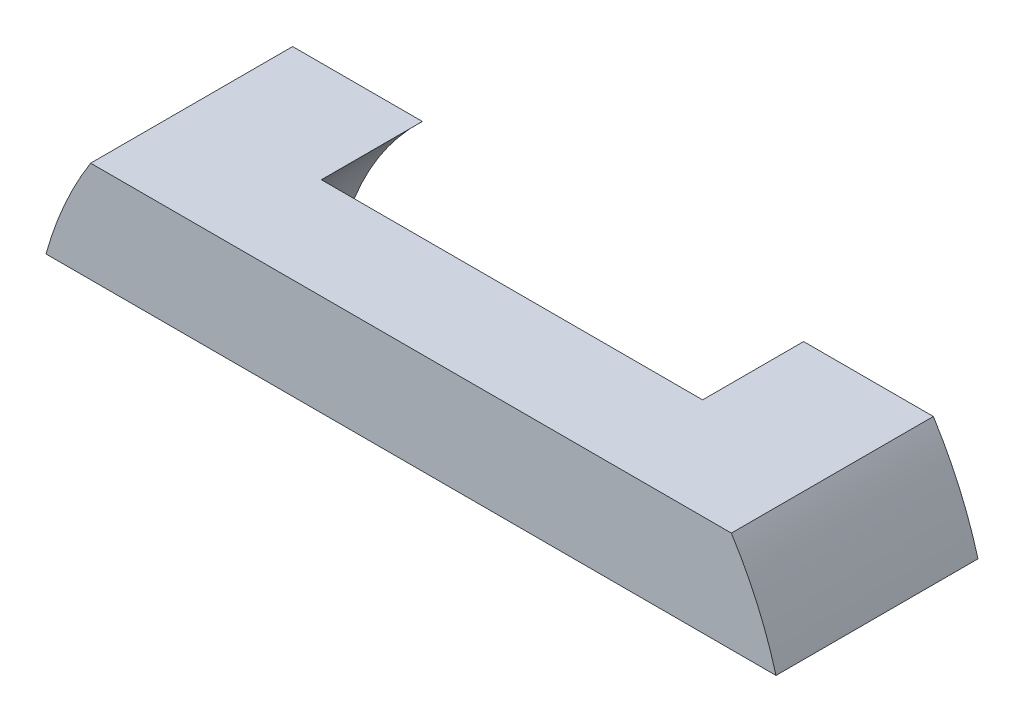
ISO-10303-21;
HEADER;
FILE_DESCRIPTION(('STEP AP214'),'2;1');
FILE_NAME('part.step','',(''),(''),'','','');
FILE_SCHEMA(('AUTOMOTIVE_DESIGN { 1 0 10303 214 1 1 1 1 }'));
ENDSEC;
DATA;
#1=APPLICATION_CONTEXT('core data for automotive mechanical design processes');
#2=APPLICATION_PROTOCOL_DEFINITION('international standard','automotive_design',2000,#1);
#3=PRODUCT_CONTEXT('',#1,'mechanical');
#4=PRODUCT('Part','Part','',(#3));
#5=PRODUCT_RELATED_PRODUCT_CATEGORY('part','',(#4));
#6=PRODUCT_DEFINITION_FORMATION('','',#4);
#7=PRODUCT_DEFINITION_CONTEXT('part definition',#1,'design');
#8=PRODUCT_DEFINITION('design','',#6,#7);
#9=PRODUCT_DEFINITION_SHAPE('','',#8);
#10=(LENGTH_UNIT() NAMED_UNIT(*) SI_UNIT(.MILLI.,.METRE.));
#11=(NAMED_UNIT(*) PLANE_ANGLE_UNIT() SI_UNIT($,.RADIAN.));
#12=(NAMED_UNIT(*) SI_UNIT($,.STERADIAN.) SOLID_ANGLE_UNIT());
#13=UNCERTAINTY_MEASURE_WITH_UNIT(LENGTH_MEASURE(1.E-05),#10,'distance_accuracy_value','');
#14=(GEOMETRIC_REPRESENTATION_CONTEXT(3) GLOBAL_UNCERTAINTY_ASSIGNED_CONTEXT((#13)) GLOBAL_UNIT_ASSIGNED_CONTEXT((#10,
#11,#12)) REPRESENTATION_CONTEXT('',''));
#15=CARTESIAN_POINT('',(0.,0.,0.));
#16=DIRECTION('',(0.,0.,1.));
#17=DIRECTION('',(1.,0.,0.));
#18=AXIS2_PLACEMENT_3D('',#15,#16,#17);
#19=CARTESIAN_POINT('',(0.,0.,0.));
#20=DIRECTION('',(0.,0.,-1.));
#21=DIRECTION('',(-1.,0.,0.));
#22=AXIS2_PLACEMENT_3D('',#19,#20,#21);
#23=PLANE('',#22);
#24=CARTESIAN_POINT('',(0.,0.,0.));
#25=DIRECTION('',(0.,0.,-1.));
#26=DIRECTION('',(-1.,0.,0.));
#27=AXIS2_PLACEMENT_3D('',#24,#25,#26);
#28=CIRCLE('',#27,8.73125);
#29=CARTESIAN_POINT('',(-8.13351717048043,3.175,0.));
#30=VERTEX_POINT('',#29);
#31=CARTESIAN_POINT('',(-5.99268108299616,6.35,0.));
#32=VERTEX_POINT('',#31);
#33=EDGE_CURVE('E302',#30,#32,#28,.T.);
#34=ORIENTED_EDGE('',*,*,#33,.F.);
#35=DIRECTION('',(1.,0.,0.));
#36=VECTOR('',#35,1.);
#37=CARTESIAN_POINT('',(-11.4751106339983,3.175,0.));
#38=LINE('',#37,#36);
#39=CARTESIAN_POINT('',(-11.4751106339983,3.175,0.));
#40=VERTEX_POINT('',#39);
#41=EDGE_CURVE('E141',#40,#30,#38,.T.);
#42=ORIENTED_EDGE('',*,*,#41,.F.);
#43=CARTESIAN_POINT('',(0.,0.,0.));
#44=DIRECTION('',(0.,0.,1.));
#45=DIRECTION('',(-1.,0.,0.));
#46=AXIS2_PLACEMENT_3D('',#43,#44,#45);
#47=CIRCLE('',#46,11.90625);
#48=CARTESIAN_POINT('',(-10.0715584227318,6.35,0.));
#49=VERTEX_POINT('',#48);
#50=EDGE_CURVE('E129',#49,#40,#47,.T.);
#51=ORIENTED_EDGE('',*,*,#50,.F.);
#52=DIRECTION('',(-1.,0.,0.));
#53=VECTOR('',#52,1.);
#54=CARTESIAN_POINT('',(-10.0715584227318,6.35,0.));
#55=LINE('',#54,#53);
#56=EDGE_CURVE('E89',#32,#49,#55,.T.);
#57=ORIENTED_EDGE('',*,*,#56,.F.);
#58=EDGE_LOOP('',(#34,#42,#51,#57));
#59=FACE_BOUND('',#58,.T.);
#60=ADVANCED_FACE('F43',(#59),#23,.T.);
#61=CARTESIAN_POINT('',(0.,0.,6.35));
#62=DIRECTION('',(0.,0.,-1.));
#63=DIRECTION('',(-1.,0.,0.));
#64=AXIS2_PLACEMENT_3D('',#61,#62,#63);
#65=CYLINDRICAL_SURFACE('',#64,11.90625);
#66=ORIENTED_EDGE('',*,*,#50,.T.);
#67=DIRECTION('',(0.,0.,-1.));
#68=VECTOR('',#67,1.);
#69=CARTESIAN_POINT('',(-11.4751106339983,3.175,6.35));
#70=LINE('',#69,#68);
#71=CARTESIAN_POINT('',(-11.4751106339983,3.175,6.35));
#72=VERTEX_POINT('',#71);
#73=EDGE_CURVE('E184',#72,#40,#70,.T.);
#74=ORIENTED_EDGE('',*,*,#73,.F.);
#75=CARTESIAN_POINT('',(0.,0.,6.35));
#76=DIRECTION('',(0.,0.,1.));
#77=DIRECTION('',(-1.,0.,0.));
#78=AXIS2_PLACEMENT_3D('',#75,#76,#77);
#79=CIRCLE('',#78,11.90625);
#80=CARTESIAN_POINT('',(-10.0715584227318,6.35,6.35));
#81=VERTEX_POINT('',#80);
#82=EDGE_CURVE('E150',#81,#72,#79,.T.);
#83=ORIENTED_EDGE('',*,*,#82,.F.);
#84=DIRECTION('',(0.,0.,-1.));
#85=VECTOR('',#84,1.);
#86=CARTESIAN_POINT('',(-10.0715584227318,6.35,6.35));
#87=LINE('',#86,#85);
#88=EDGE_CURVE('E161',#81,#49,#87,.T.);
#89=ORIENTED_EDGE('',*,*,#88,.T.);
#90=EDGE_LOOP('',(#66,#74,#83,#89));
#91=FACE_BOUND('',#90,.T.);
#92=ADVANCED_FACE('F45',(#91),#65,.T.);
#93=CARTESIAN_POINT('',(-11.4751106339983,3.175,6.35));
#94=DIRECTION('',(0.,1.,0.));
#95=DIRECTION('',(0.,0.,1.));
#96=AXIS2_PLACEMENT_3D('',#93,#94,#95);
#97=PLANE('',#96);
#98=DIRECTION('',(-1.,0.,0.));
#99=VECTOR('',#98,1.);
#100=CARTESIAN_POINT('',(-11.4751106339983,3.175,3.175));
#101=LINE('',#100,#99);
#102=CARTESIAN_POINT('',(8.13351717048043,3.175,3.175));
#103=VERTEX_POINT('',#102);
#104=CARTESIAN_POINT('',(-8.13351717048043,3.175,3.175));
#105=VERTEX_POINT('',#104);
#106=EDGE_CURVE('E120',#103,#105,#101,.T.);
#107=ORIENTED_EDGE('',*,*,#106,.F.);
#108=DIRECTION('',(0.,0.,-1.));
#109=VECTOR('',#108,1.);
#110=CARTESIAN_POINT('',(8.13351717048043,3.175,3.175));
#111=LINE('',#110,#109);
#112=CARTESIAN_POINT('',(8.13351717048043,3.175,0.));
#113=VERTEX_POINT('',#112);
#114=EDGE_CURVE('E130',#103,#113,#111,.T.);
#115=ORIENTED_EDGE('',*,*,#114,.T.);
#116=CARTESIAN_POINT('',(11.4751106339983,3.175,0.));
#117=VERTEX_POINT('',#116);
#118=EDGE_CURVE('E165',#113,#117,#38,.T.);
#119=ORIENTED_EDGE('',*,*,#118,.T.);
#120=DIRECTION('',(0.,0.,-1.));
#121=VECTOR('',#120,1.);
#122=CARTESIAN_POINT('',(11.4751106339983,3.175,6.35));
#123=LINE('',#122,#121);
#124=CARTESIAN_POINT('',(11.4751106339983,3.175,6.35));
#125=VERTEX_POINT('',#124);
#126=EDGE_CURVE('E180',#125,#117,#123,.T.);
#127=ORIENTED_EDGE('',*,*,#126,.F.);
#128=DIRECTION('',(1.,0.,0.));
#129=VECTOR('',#128,1.);
#130=CARTESIAN_POINT('',(-11.4751106339983,3.175,6.35));
#131=LINE('',#130,#129);
#132=EDGE_CURVE('E97',#72,#125,#131,.T.);
#133=ORIENTED_EDGE('',*,*,#132,.F.);
#134=ORIENTED_EDGE('',*,*,#73,.T.);
#135=ORIENTED_EDGE('',*,*,#41,.T.);
#136=DIRECTION('',(0.,0.,-1.));
#137=VECTOR('',#136,1.);
#138=CARTESIAN_POINT('',(-8.13351717048043,3.175,3.175));
#139=LINE('',#138,#137);
#140=EDGE_CURVE('E134',#30,#105,#139,.F.);
#141=ORIENTED_EDGE('',*,*,#140,.T.);
#142=EDGE_LOOP('',(#107,#115,#119,#127,#133,#134,#135,#141));
#143=FACE_BOUND('',#142,.T.);
#144=ADVANCED_FACE('F140',(#143),#97,.F.);
#145=CARTESIAN_POINT('',(0.,0.,6.35));
#146=DIRECTION('',(0.,0.,-1.));
#147=DIRECTION('',(-1.,0.,0.));
#148=AXIS2_PLACEMENT_3D('',#145,#146,#147);
#149=CYLINDRICAL_SURFACE('',#148,11.90625);
#150=CARTESIAN_POINT('',(0.,0.,0.));
#151=DIRECTION('',(0.,0.,1.));
#152=DIRECTION('',(1.,0.,0.));
#153=AXIS2_PLACEMENT_3D('',#150,#151,#152);
#154=CIRCLE('',#153,11.90625);
#155=CARTESIAN_POINT('',(10.0715584227318,6.35,0.));
#156=VERTEX_POINT('',#155);
#157=EDGE_CURVE('E168',#117,#156,#154,.T.);
#158=ORIENTED_EDGE('',*,*,#157,.T.);
#159=DIRECTION('',(0.,0.,-1.));
#160=VECTOR('',#159,1.);
#161=CARTESIAN_POINT('',(10.0715584227318,6.35,6.35));
#162=LINE('',#161,#160);
#163=CARTESIAN_POINT('',(10.0715584227318,6.35,6.35));
#164=VERTEX_POINT('',#163);
#165=EDGE_CURVE('E176',#164,#156,#162,.T.);
#166=ORIENTED_EDGE('',*,*,#165,.F.);
#167=CARTESIAN_POINT('',(0.,0.,6.35));
#168=DIRECTION('',(0.,0.,1.));
#169=DIRECTION('',(1.,0.,0.));
#170=AXIS2_PLACEMENT_3D('',#167,#168,#169);
#171=CIRCLE('',#170,11.90625);
#172=EDGE_CURVE('E156',#125,#164,#171,.T.);
#173=ORIENTED_EDGE('',*,*,#172,.F.);
#174=ORIENTED_EDGE('',*,*,#126,.T.);
#175=EDGE_LOOP('',(#158,#166,#173,#174));
#176=FACE_BOUND('',#175,.T.);
#177=ADVANCED_FACE('F197',(#176),#149,.T.);
#178=CARTESIAN_POINT('',(-10.0715584227318,6.35,6.35));
#179=DIRECTION('',(0.,-1.,0.));
#180=DIRECTION('',(0.,0.,-1.));
#181=AXIS2_PLACEMENT_3D('',#178,#179,#180);
#182=PLANE('',#181);
#183=DIRECTION('',(1.,0.,0.));
#184=VECTOR('',#183,1.);
#185=CARTESIAN_POINT('',(-10.0715584227318,6.35,3.175));
#186=LINE('',#185,#184);
#187=CARTESIAN_POINT('',(-5.99268108299616,6.35,3.175));
#188=VERTEX_POINT('',#187);
#189=CARTESIAN_POINT('',(5.99268108299616,6.35,3.175));
#190=VERTEX_POINT('',#189);
#191=EDGE_CURVE('E11',#188,#190,#186,.T.);
#192=ORIENTED_EDGE('',*,*,#191,.F.);
#193=DIRECTION('',(0.,0.,-1.));
#194=VECTOR('',#193,1.);
#195=CARTESIAN_POINT('',(-5.99268108299616,6.35,3.175));
#196=LINE('',#195,#194);
#197=EDGE_CURVE('E136',#188,#32,#196,.T.);
#198=ORIENTED_EDGE('',*,*,#197,.T.);
#199=ORIENTED_EDGE('',*,*,#56,.T.);
#200=ORIENTED_EDGE('',*,*,#88,.F.);
#201=DIRECTION('',(-1.,0.,0.));
#202=VECTOR('',#201,1.);
#203=CARTESIAN_POINT('',(-10.0715584227318,6.35,6.35));
#204=LINE('',#203,#202);
#205=EDGE_CURVE('E68',#164,#81,#204,.T.);
#206=ORIENTED_EDGE('',*,*,#205,.F.);
#207=ORIENTED_EDGE('',*,*,#165,.T.);
#208=CARTESIAN_POINT('',(5.99268108299616,6.35,0.));
#209=VERTEX_POINT('',#208);
#210=EDGE_CURVE('E153',#156,#209,#55,.T.);
#211=ORIENTED_EDGE('',*,*,#210,.T.);
#212=DIRECTION('',(0.,0.,-1.));
#213=VECTOR('',#212,1.);
#214=CARTESIAN_POINT('',(5.99268108299616,6.35,3.175));
#215=LINE('',#214,#213);
#216=EDGE_CURVE('E59',#209,#190,#215,.F.);
#217=ORIENTED_EDGE('',*,*,#216,.T.);
#218=EDGE_LOOP('',(#192,#198,#199,#200,#206,#207,#211,#217));
#219=FACE_BOUND('',#218,.T.);
#220=ADVANCED_FACE('F199',(#219),#182,.F.);
#221=CARTESIAN_POINT('',(0.,0.,6.35));
#222=DIRECTION('',(0.,0.,-1.));
#223=DIRECTION('',(-1.,0.,0.));
#224=AXIS2_PLACEMENT_3D('',#221,#222,#223);
#225=PLANE('',#224);
#226=ORIENTED_EDGE('',*,*,#82,.T.);
#227=ORIENTED_EDGE('',*,*,#132,.T.);
#228=ORIENTED_EDGE('',*,*,#172,.T.);
#229=ORIENTED_EDGE('',*,*,#205,.T.);
#230=EDGE_LOOP('',(#226,#227,#228,#229));
#231=FACE_BOUND('',#230,.T.);
#232=ADVANCED_FACE('F204',(#231),#225,.F.);
#233=CARTESIAN_POINT('',(0.,0.,0.));
#234=DIRECTION('',(0.,0.,-1.));
#235=DIRECTION('',(-1.,0.,0.));
#236=AXIS2_PLACEMENT_3D('',#233,#234,#235);
#237=CIRCLE('',#236,8.73125);
#238=EDGE_CURVE('E52',#209,#113,#237,.T.);
#239=ORIENTED_EDGE('',*,*,#238,.F.);
#240=ORIENTED_EDGE('',*,*,#210,.F.);
#241=ORIENTED_EDGE('',*,*,#157,.F.);
#242=ORIENTED_EDGE('',*,*,#118,.F.);
#243=EDGE_LOOP('',(#239,#240,#241,#242));
#244=FACE_BOUND('',#243,.T.);
#245=ADVANCED_FACE('F192',(#244),#23,.T.);
#246=CARTESIAN_POINT('',(0.,0.,3.175));
#247=DIRECTION('',(0.,0.,-1.));
#248=DIRECTION('',(-1.,0.,0.));
#249=AXIS2_PLACEMENT_3D('',#246,#247,#248);
#250=PLANE('',#249);
#251=ORIENTED_EDGE('',*,*,#106,.T.);
#252=CARTESIAN_POINT('',(0.,0.,3.175));
#253=DIRECTION('',(0.,0.,-1.));
#254=DIRECTION('',(-1.,0.,0.));
#255=AXIS2_PLACEMENT_3D('',#252,#253,#254);
#256=CIRCLE('',#255,8.73125);
#257=EDGE_CURVE('E123',#105,#188,#256,.T.);
#258=ORIENTED_EDGE('',*,*,#257,.T.);
#259=ORIENTED_EDGE('',*,*,#191,.T.);
#260=EDGE_CURVE('E125',#190,#103,#256,.T.);
#261=ORIENTED_EDGE('',*,*,#260,.T.);
#262=EDGE_LOOP('',(#251,#258,#259,#261));
#263=FACE_BOUND('',#262,.T.);
#264=ADVANCED_FACE('F122',(#263),#250,.T.);
#265=CARTESIAN_POINT('',(0.,0.,3.175));
#266=DIRECTION('',(0.,0.,-1.));
#267=DIRECTION('',(-1.,0.,0.));
#268=AXIS2_PLACEMENT_3D('',#265,#266,#267);
#269=CYLINDRICAL_SURFACE('',#268,8.73125);
#270=ORIENTED_EDGE('',*,*,#260,.F.);
#271=ORIENTED_EDGE('',*,*,#216,.F.);
#272=ORIENTED_EDGE('',*,*,#238,.T.);
#273=ORIENTED_EDGE('',*,*,#114,.F.);
#274=EDGE_LOOP('',(#270,#271,#272,#273));
#275=FACE_BOUND('',#274,.T.);
#276=ADVANCED_FACE('F187',(#275),#269,.F.);
#277=ORIENTED_EDGE('',*,*,#33,.T.);
#278=ORIENTED_EDGE('',*,*,#197,.F.);
#279=ORIENTED_EDGE('',*,*,#257,.F.);
#280=ORIENTED_EDGE('',*,*,#140,.F.);
#281=EDGE_LOOP('',(#277,#278,#279,#280));
#282=FACE_BOUND('',#281,.T.);
#283=ADVANCED_FACE('F133',(#282),#269,.F.);
#284=CLOSED_SHELL('',(#60,#92,#144,#177,#220,#232,#245,#264,#276,#283));
#285=MANIFOLD_SOLID_BREP('B2',#284);
#286=ADVANCED_BREP_SHAPE_REPRESENTATION('',(#18,#285),#14);
#287=SHAPE_DEFINITION_REPRESENTATION(#9,#286);
ENDSEC;
END-ISO-10303-21;
